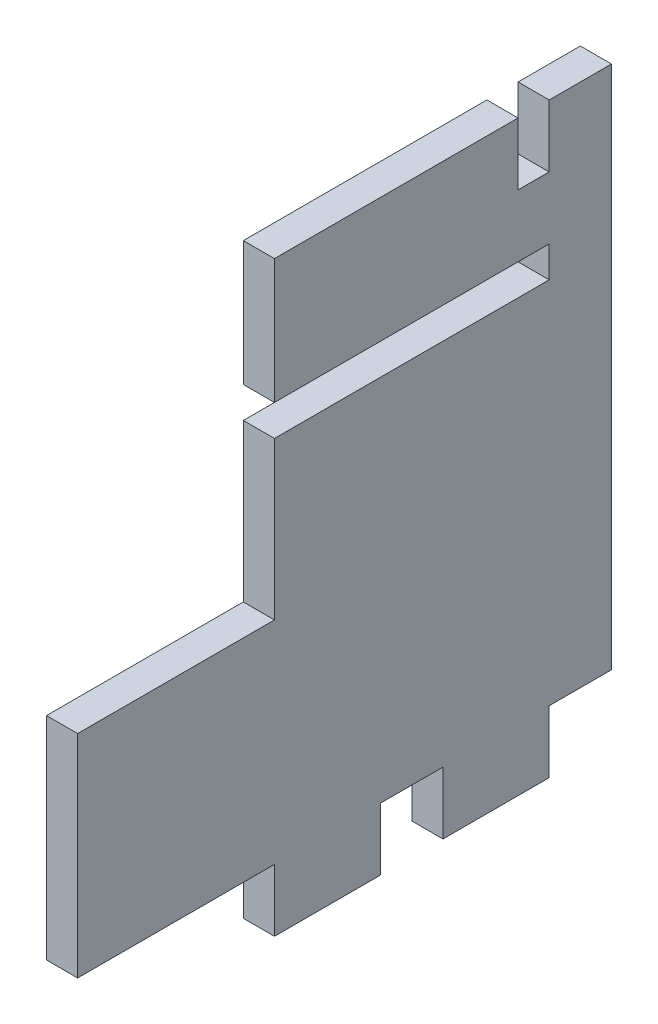
ISO-10303-21;
HEADER;
FILE_DESCRIPTION(('STEP AP214'),'2;1');
FILE_NAME('part.step','',(''),(''),'','','');
FILE_SCHEMA(('AUTOMOTIVE_DESIGN { 1 0 10303 214 1 1 1 1 }'));
ENDSEC;
DATA;
#1=APPLICATION_CONTEXT('core data for automotive mechanical design processes');
#2=APPLICATION_PROTOCOL_DEFINITION('international standard','automotive_design',2000,#1);
#3=PRODUCT_CONTEXT('',#1,'mechanical');
#4=PRODUCT('Part','Part','',(#3));
#5=PRODUCT_RELATED_PRODUCT_CATEGORY('part','',(#4));
#6=PRODUCT_DEFINITION_FORMATION('','',#4);
#7=PRODUCT_DEFINITION_CONTEXT('part definition',#1,'design');
#8=PRODUCT_DEFINITION('design','',#6,#7);
#9=PRODUCT_DEFINITION_SHAPE('','',#8);
#10=(LENGTH_UNIT() NAMED_UNIT(*) SI_UNIT(.MILLI.,.METRE.));
#11=(NAMED_UNIT(*) PLANE_ANGLE_UNIT() SI_UNIT($,.RADIAN.));
#12=(NAMED_UNIT(*) SI_UNIT($,.STERADIAN.) SOLID_ANGLE_UNIT());
#13=UNCERTAINTY_MEASURE_WITH_UNIT(LENGTH_MEASURE(1.E-05),#10,'distance_accuracy_value','');
#14=(GEOMETRIC_REPRESENTATION_CONTEXT(3) GLOBAL_UNCERTAINTY_ASSIGNED_CONTEXT((#13)) GLOBAL_UNIT_ASSIGNED_CONTEXT((#10,
#11,#12)) REPRESENTATION_CONTEXT('',''));
#15=CARTESIAN_POINT('',(0.,0.,0.));
#16=DIRECTION('',(0.,0.,1.));
#17=DIRECTION('',(1.,0.,0.));
#18=AXIS2_PLACEMENT_3D('',#15,#16,#17);
#19=CARTESIAN_POINT('',(3.175,-21.971,0.));
#20=DIRECTION('',(0.,1.,0.));
#21=DIRECTION('',(0.,0.,1.));
#22=AXIS2_PLACEMENT_3D('',#19,#20,#21);
#23=PLANE('',#22);
#24=DIRECTION('',(0.,0.,-1.));
#25=VECTOR('',#24,1.);
#26=CARTESIAN_POINT('',(0.,-21.971,0.));
#27=LINE('',#26,#25);
#28=CARTESIAN_POINT('',(0.,-21.971,-3.175));
#29=VERTEX_POINT('',#28);
#30=CARTESIAN_POINT('',(0.,-21.971,-14.));
#31=VERTEX_POINT('',#30);
#32=EDGE_CURVE('E217',#29,#31,#27,.T.);
#33=ORIENTED_EDGE('',*,*,#32,.T.);
#34=DIRECTION('',(-1.,0.,0.));
#35=VECTOR('',#34,1.);
#36=CARTESIAN_POINT('',(3.175,-21.971,-14.));
#37=LINE('',#36,#35);
#38=CARTESIAN_POINT('',(3.175,-21.971,-14.));
#39=VERTEX_POINT('',#38);
#40=EDGE_CURVE('E11',#39,#31,#37,.T.);
#41=ORIENTED_EDGE('',*,*,#40,.F.);
#42=DIRECTION('',(0.,0.,-1.));
#43=VECTOR('',#42,1.);
#44=CARTESIAN_POINT('',(3.175,-21.971,0.));
#45=LINE('',#44,#43);
#46=CARTESIAN_POINT('',(3.175,-21.971,-3.175));
#47=VERTEX_POINT('',#46);
#48=EDGE_CURVE('E134',#47,#39,#45,.T.);
#49=ORIENTED_EDGE('',*,*,#48,.F.);
#50=DIRECTION('',(-1.,0.,0.));
#51=VECTOR('',#50,1.);
#52=CARTESIAN_POINT('',(3.175,-21.971,-3.175));
#53=LINE('',#52,#51);
#54=EDGE_CURVE('E54',#47,#29,#53,.T.);
#55=ORIENTED_EDGE('',*,*,#54,.T.);
#56=EDGE_LOOP('',(#33,#41,#49,#55));
#57=FACE_BOUND('',#56,.T.);
#58=ADVANCED_FACE('F38',(#57),#23,.F.);
#59=CARTESIAN_POINT('',(3.175,0.,-14.));
#60=DIRECTION('',(0.,0.,-1.));
#61=DIRECTION('',(0.,1.,0.));
#62=AXIS2_PLACEMENT_3D('',#59,#60,#61);
#63=PLANE('',#62);
#64=DIRECTION('',(0.,-1.,0.));
#65=VECTOR('',#64,1.);
#66=CARTESIAN_POINT('',(0.,0.,-14.));
#67=LINE('',#66,#65);
#68=CARTESIAN_POINT('',(0.,-15.621,-14.));
#69=VERTEX_POINT('',#68);
#70=EDGE_CURVE('E219',#69,#31,#67,.T.);
#71=ORIENTED_EDGE('',*,*,#70,.F.);
#72=DIRECTION('',(-1.,0.,0.));
#73=VECTOR('',#72,1.);
#74=CARTESIAN_POINT('',(3.175,-15.621,-14.));
#75=LINE('',#74,#73);
#76=CARTESIAN_POINT('',(3.175,-15.621,-14.));
#77=VERTEX_POINT('',#76);
#78=EDGE_CURVE('E46',#77,#69,#75,.T.);
#79=ORIENTED_EDGE('',*,*,#78,.F.);
#80=DIRECTION('',(0.,-1.,0.));
#81=VECTOR('',#80,1.);
#82=CARTESIAN_POINT('',(3.175,0.,-14.));
#83=LINE('',#82,#81);
#84=EDGE_CURVE('E323',#77,#39,#83,.T.);
#85=ORIENTED_EDGE('',*,*,#84,.T.);
#86=ORIENTED_EDGE('',*,*,#40,.T.);
#87=EDGE_LOOP('',(#71,#79,#85,#86));
#88=FACE_BOUND('',#87,.T.);
#89=ADVANCED_FACE('F322',(#88),#63,.T.);
#90=CARTESIAN_POINT('',(3.175,-15.621,0.));
#91=DIRECTION('',(0.,1.,0.));
#92=DIRECTION('',(0.,0.,1.));
#93=AXIS2_PLACEMENT_3D('',#90,#91,#92);
#94=PLANE('',#93);
#95=DIRECTION('',(0.,0.,-1.));
#96=VECTOR('',#95,1.);
#97=CARTESIAN_POINT('',(0.,-15.621,0.));
#98=LINE('',#97,#96);
#99=CARTESIAN_POINT('',(0.,-15.621,-20.35));
#100=VERTEX_POINT('',#99);
#101=EDGE_CURVE('E222',#69,#100,#98,.T.);
#102=ORIENTED_EDGE('',*,*,#101,.T.);
#103=DIRECTION('',(-1.,0.,0.));
#104=VECTOR('',#103,1.);
#105=CARTESIAN_POINT('',(3.175,-15.621,-20.35));
#106=LINE('',#105,#104);
#107=CARTESIAN_POINT('',(3.175,-15.621,-20.35));
#108=VERTEX_POINT('',#107);
#109=EDGE_CURVE('E308',#108,#100,#106,.T.);
#110=ORIENTED_EDGE('',*,*,#109,.F.);
#111=DIRECTION('',(0.,0.,-1.));
#112=VECTOR('',#111,1.);
#113=CARTESIAN_POINT('',(3.175,-15.621,0.));
#114=LINE('',#113,#112);
#115=EDGE_CURVE('E314',#77,#108,#114,.T.);
#116=ORIENTED_EDGE('',*,*,#115,.F.);
#117=ORIENTED_EDGE('',*,*,#78,.T.);
#118=EDGE_LOOP('',(#102,#110,#116,#117));
#119=FACE_BOUND('',#118,.T.);
#120=ADVANCED_FACE('F312',(#119),#94,.F.);
#121=CARTESIAN_POINT('',(3.175,0.,-20.35));
#122=DIRECTION('',(0.,0.,-1.));
#123=DIRECTION('',(0.,1.,0.));
#124=AXIS2_PLACEMENT_3D('',#121,#122,#123);
#125=PLANE('',#124);
#126=DIRECTION('',(0.,-1.,0.));
#127=VECTOR('',#126,1.);
#128=CARTESIAN_POINT('',(0.,0.,-20.35));
#129=LINE('',#128,#127);
#130=CARTESIAN_POINT('',(0.,37.846,-20.35));
#131=VERTEX_POINT('',#130);
#132=EDGE_CURVE('E225',#131,#100,#129,.T.);
#133=ORIENTED_EDGE('',*,*,#132,.F.);
#134=DIRECTION('',(-1.,0.,0.));
#135=VECTOR('',#134,1.);
#136=CARTESIAN_POINT('',(3.175,37.846,-20.35));
#137=LINE('',#136,#135);
#138=CARTESIAN_POINT('',(3.175,37.846,-20.35));
#139=VERTEX_POINT('',#138);
#140=EDGE_CURVE('E306',#139,#131,#137,.T.);
#141=ORIENTED_EDGE('',*,*,#140,.F.);
#142=DIRECTION('',(0.,-1.,0.));
#143=VECTOR('',#142,1.);
#144=CARTESIAN_POINT('',(3.175,0.,-20.35));
#145=LINE('',#144,#143);
#146=EDGE_CURVE('E701',#139,#108,#145,.T.);
#147=ORIENTED_EDGE('',*,*,#146,.T.);
#148=ORIENTED_EDGE('',*,*,#109,.T.);
#149=EDGE_LOOP('',(#133,#141,#147,#148));
#150=FACE_BOUND('',#149,.T.);
#151=ADVANCED_FACE('F341',(#150),#125,.T.);
#152=CARTESIAN_POINT('',(3.175,37.846,0.));
#153=DIRECTION('',(0.,-1.,0.));
#154=DIRECTION('',(0.,0.,-1.));
#155=AXIS2_PLACEMENT_3D('',#152,#153,#154);
#156=PLANE('',#155);
#157=DIRECTION('',(0.,0.,1.));
#158=VECTOR('',#157,1.);
#159=CARTESIAN_POINT('',(0.,37.846,0.));
#160=LINE('',#159,#158);
#161=CARTESIAN_POINT('',(0.,37.846,-14.));
#162=VERTEX_POINT('',#161);
#163=EDGE_CURVE('E228',#131,#162,#160,.T.);
#164=ORIENTED_EDGE('',*,*,#163,.T.);
#165=DIRECTION('',(-1.,0.,0.));
#166=VECTOR('',#165,1.);
#167=CARTESIAN_POINT('',(3.175,37.846,-14.));
#168=LINE('',#167,#166);
#169=CARTESIAN_POINT('',(3.175,37.846,-14.));
#170=VERTEX_POINT('',#169);
#171=EDGE_CURVE('E303',#170,#162,#168,.T.);
#172=ORIENTED_EDGE('',*,*,#171,.F.);
#173=DIRECTION('',(0.,0.,1.));
#174=VECTOR('',#173,1.);
#175=CARTESIAN_POINT('',(3.175,37.846,0.));
#176=LINE('',#175,#174);
#177=EDGE_CURVE('E649',#139,#170,#176,.T.);
#178=ORIENTED_EDGE('',*,*,#177,.F.);
#179=ORIENTED_EDGE('',*,*,#140,.T.);
#180=EDGE_LOOP('',(#164,#172,#178,#179));
#181=FACE_BOUND('',#180,.T.);
#182=ADVANCED_FACE('F346',(#181),#156,.F.);
#183=CARTESIAN_POINT('',(3.175,0.,-14.));
#184=DIRECTION('',(0.,0.,-1.));
#185=DIRECTION('',(-1.,0.,0.));
#186=AXIS2_PLACEMENT_3D('',#183,#184,#185);
#187=PLANE('',#186);
#188=DIRECTION('',(0.,-1.,0.));
#189=VECTOR('',#188,1.);
#190=CARTESIAN_POINT('',(0.,0.,-14.));
#191=LINE('',#190,#189);
#192=CARTESIAN_POINT('',(0.,31.496,-14.));
#193=VERTEX_POINT('',#192);
#194=EDGE_CURVE('E230',#162,#193,#191,.T.);
#195=ORIENTED_EDGE('',*,*,#194,.T.);
#196=DIRECTION('',(-1.,0.,0.));
#197=VECTOR('',#196,1.);
#198=CARTESIAN_POINT('',(3.175,31.496,-14.));
#199=LINE('',#198,#197);
#200=CARTESIAN_POINT('',(3.175,31.496,-14.));
#201=VERTEX_POINT('',#200);
#202=EDGE_CURVE('E300',#201,#193,#199,.T.);
#203=ORIENTED_EDGE('',*,*,#202,.F.);
#204=DIRECTION('',(0.,-1.,0.));
#205=VECTOR('',#204,1.);
#206=CARTESIAN_POINT('',(3.175,0.,-14.));
#207=LINE('',#206,#205);
#208=EDGE_CURVE('E636',#170,#201,#207,.T.);
#209=ORIENTED_EDGE('',*,*,#208,.F.);
#210=ORIENTED_EDGE('',*,*,#171,.T.);
#211=EDGE_LOOP('',(#195,#203,#209,#210));
#212=FACE_BOUND('',#211,.T.);
#213=ADVANCED_FACE('F348',(#212),#187,.F.);
#214=CARTESIAN_POINT('',(3.175,31.496,0.));
#215=DIRECTION('',(0.,-1.,0.));
#216=DIRECTION('',(0.,0.,-1.));
#217=AXIS2_PLACEMENT_3D('',#214,#215,#216);
#218=PLANE('',#217);
#219=DIRECTION('',(0.,0.,1.));
#220=VECTOR('',#219,1.);
#221=CARTESIAN_POINT('',(0.,31.496,0.));
#222=LINE('',#221,#220);
#223=CARTESIAN_POINT('',(0.,31.496,-10.825));
#224=VERTEX_POINT('',#223);
#225=EDGE_CURVE('E233',#193,#224,#222,.T.);
#226=ORIENTED_EDGE('',*,*,#225,.T.);
#227=DIRECTION('',(-1.,0.,0.));
#228=VECTOR('',#227,1.);
#229=CARTESIAN_POINT('',(3.175,31.496,-10.825));
#230=LINE('',#229,#228);
#231=CARTESIAN_POINT('',(3.175,31.496,-10.825));
#232=VERTEX_POINT('',#231);
#233=EDGE_CURVE('E298',#232,#224,#230,.T.);
#234=ORIENTED_EDGE('',*,*,#233,.F.);
#235=DIRECTION('',(0.,0.,1.));
#236=VECTOR('',#235,1.);
#237=CARTESIAN_POINT('',(3.175,31.496,0.));
#238=LINE('',#237,#236);
#239=EDGE_CURVE('E643',#201,#232,#238,.T.);
#240=ORIENTED_EDGE('',*,*,#239,.F.);
#241=ORIENTED_EDGE('',*,*,#202,.T.);
#242=EDGE_LOOP('',(#226,#234,#240,#241));
#243=FACE_BOUND('',#242,.T.);
#244=ADVANCED_FACE('F351',(#243),#218,.F.);
#245=CARTESIAN_POINT('',(3.175,0.,-10.825));
#246=DIRECTION('',(0.,0.,-1.));
#247=DIRECTION('',(0.,1.,0.));
#248=AXIS2_PLACEMENT_3D('',#245,#246,#247);
#249=PLANE('',#248);
#250=DIRECTION('',(0.,-1.,0.));
#251=VECTOR('',#250,1.);
#252=CARTESIAN_POINT('',(0.,0.,-10.825));
#253=LINE('',#252,#251);
#254=CARTESIAN_POINT('',(0.,37.846,-10.825));
#255=VERTEX_POINT('',#254);
#256=EDGE_CURVE('E236',#255,#224,#253,.T.);
#257=ORIENTED_EDGE('',*,*,#256,.F.);
#258=DIRECTION('',(-1.,0.,0.));
#259=VECTOR('',#258,1.);
#260=CARTESIAN_POINT('',(3.175,37.846,-10.825));
#261=LINE('',#260,#259);
#262=CARTESIAN_POINT('',(3.175,37.846,-10.825));
#263=VERTEX_POINT('',#262);
#264=EDGE_CURVE('E296',#263,#255,#261,.T.);
#265=ORIENTED_EDGE('',*,*,#264,.F.);
#266=DIRECTION('',(0.,-1.,0.));
#267=VECTOR('',#266,1.);
#268=CARTESIAN_POINT('',(3.175,0.,-10.825));
#269=LINE('',#268,#267);
#270=EDGE_CURVE('E645',#263,#232,#269,.T.);
#271=ORIENTED_EDGE('',*,*,#270,.T.);
#272=ORIENTED_EDGE('',*,*,#233,.T.);
#273=EDGE_LOOP('',(#257,#265,#271,#272));
#274=FACE_BOUND('',#273,.T.);
#275=ADVANCED_FACE('F355',(#274),#249,.T.);
#276=CARTESIAN_POINT('',(0.,37.846,14.));
#277=VERTEX_POINT('',#276);
#278=EDGE_CURVE('E231',#255,#277,#160,.T.);
#279=ORIENTED_EDGE('',*,*,#278,.T.);
#280=DIRECTION('',(-1.,0.,0.));
#281=VECTOR('',#280,1.);
#282=CARTESIAN_POINT('',(3.175,37.846,14.));
#283=LINE('',#282,#281);
#284=CARTESIAN_POINT('',(3.175,37.846,14.));
#285=VERTEX_POINT('',#284);
#286=EDGE_CURVE('E294',#285,#277,#283,.T.);
#287=ORIENTED_EDGE('',*,*,#286,.F.);
#288=EDGE_CURVE('E647',#263,#285,#176,.T.);
#289=ORIENTED_EDGE('',*,*,#288,.F.);
#290=ORIENTED_EDGE('',*,*,#264,.T.);
#291=EDGE_LOOP('',(#279,#287,#289,#290));
#292=FACE_BOUND('',#291,.T.);
#293=ADVANCED_FACE('F359',(#292),#156,.F.);
#294=CARTESIAN_POINT('',(3.175,0.,14.));
#295=DIRECTION('',(0.,0.,1.));
#296=DIRECTION('',(0.,-1.,0.));
#297=AXIS2_PLACEMENT_3D('',#294,#295,#296);
#298=PLANE('',#297);
#299=DIRECTION('',(0.,1.,0.));
#300=VECTOR('',#299,1.);
#301=CARTESIAN_POINT('',(0.,0.,14.));
#302=LINE('',#301,#300);
#303=CARTESIAN_POINT('',(0.,25.146,14.));
#304=VERTEX_POINT('',#303);
#305=EDGE_CURVE('E239',#304,#277,#302,.T.);
#306=ORIENTED_EDGE('',*,*,#305,.F.);
#307=DIRECTION('',(-1.,0.,0.));
#308=VECTOR('',#307,1.);
#309=CARTESIAN_POINT('',(3.175,25.146,14.));
#310=LINE('',#309,#308);
#311=CARTESIAN_POINT('',(3.175,25.146,14.));
#312=VERTEX_POINT('',#311);
#313=EDGE_CURVE('E292',#312,#304,#310,.T.);
#314=ORIENTED_EDGE('',*,*,#313,.F.);
#315=DIRECTION('',(0.,1.,0.));
#316=VECTOR('',#315,1.);
#317=CARTESIAN_POINT('',(3.175,0.,14.));
#318=LINE('',#317,#316);
#319=EDGE_CURVE('E653',#312,#285,#318,.T.);
#320=ORIENTED_EDGE('',*,*,#319,.T.);
#321=ORIENTED_EDGE('',*,*,#286,.T.);
#322=EDGE_LOOP('',(#306,#314,#320,#321));
#323=FACE_BOUND('',#322,.T.);
#324=ADVANCED_FACE('F363',(#323),#298,.T.);
#325=CARTESIAN_POINT('',(3.175,25.146,0.));
#326=DIRECTION('',(0.,-1.,0.));
#327=DIRECTION('',(0.,0.,-1.));
#328=AXIS2_PLACEMENT_3D('',#325,#326,#327);
#329=PLANE('',#328);
#330=DIRECTION('',(0.,0.,1.));
#331=VECTOR('',#330,1.);
#332=CARTESIAN_POINT('',(0.,25.146,0.));
#333=LINE('',#332,#331);
#334=CARTESIAN_POINT('',(0.,25.146,-14.));
#335=VERTEX_POINT('',#334);
#336=EDGE_CURVE('E242',#335,#304,#333,.T.);
#337=ORIENTED_EDGE('',*,*,#336,.F.);
#338=DIRECTION('',(-1.,0.,0.));
#339=VECTOR('',#338,1.);
#340=CARTESIAN_POINT('',(3.175,25.146,-14.));
#341=LINE('',#340,#339);
#342=CARTESIAN_POINT('',(3.175,25.146,-14.));
#343=VERTEX_POINT('',#342);
#344=EDGE_CURVE('E290',#343,#335,#341,.T.);
#345=ORIENTED_EDGE('',*,*,#344,.F.);
#346=DIRECTION('',(0.,0.,1.));
#347=VECTOR('',#346,1.);
#348=CARTESIAN_POINT('',(3.175,25.146,0.));
#349=LINE('',#348,#347);
#350=EDGE_CURVE('E656',#343,#312,#349,.T.);
#351=ORIENTED_EDGE('',*,*,#350,.T.);
#352=ORIENTED_EDGE('',*,*,#313,.T.);
#353=EDGE_LOOP('',(#337,#345,#351,#352));
#354=FACE_BOUND('',#353,.T.);
#355=ADVANCED_FACE('F367',(#354),#329,.T.);
#356=CARTESIAN_POINT('',(3.175,0.,-14.));
#357=DIRECTION('',(0.,0.,1.));
#358=DIRECTION('',(1.,0.,0.));
#359=AXIS2_PLACEMENT_3D('',#356,#357,#358);
#360=PLANE('',#359);
#361=DIRECTION('',(0.,1.,0.));
#362=VECTOR('',#361,1.);
#363=CARTESIAN_POINT('',(0.,0.,-14.));
#364=LINE('',#363,#362);
#365=CARTESIAN_POINT('',(0.,21.971,-14.));
#366=VERTEX_POINT('',#365);
#367=EDGE_CURVE('E245',#366,#335,#364,.T.);
#368=ORIENTED_EDGE('',*,*,#367,.F.);
#369=DIRECTION('',(-1.,0.,0.));
#370=VECTOR('',#369,1.);
#371=CARTESIAN_POINT('',(3.175,21.971,-14.));
#372=LINE('',#371,#370);
#373=CARTESIAN_POINT('',(3.175,21.971,-14.));
#374=VERTEX_POINT('',#373);
#375=EDGE_CURVE('E288',#374,#366,#372,.T.);
#376=ORIENTED_EDGE('',*,*,#375,.F.);
#377=DIRECTION('',(0.,1.,0.));
#378=VECTOR('',#377,1.);
#379=CARTESIAN_POINT('',(3.175,0.,-14.));
#380=LINE('',#379,#378);
#381=EDGE_CURVE('E659',#374,#343,#380,.T.);
#382=ORIENTED_EDGE('',*,*,#381,.T.);
#383=ORIENTED_EDGE('',*,*,#344,.T.);
#384=EDGE_LOOP('',(#368,#376,#382,#383));
#385=FACE_BOUND('',#384,.T.);
#386=ADVANCED_FACE('F371',(#385),#360,.T.);
#387=CARTESIAN_POINT('',(3.175,21.971,0.));
#388=DIRECTION('',(0.,1.,0.));
#389=DIRECTION('',(0.,0.,1.));
#390=AXIS2_PLACEMENT_3D('',#387,#388,#389);
#391=PLANE('',#390);
#392=DIRECTION('',(0.,0.,-1.));
#393=VECTOR('',#392,1.);
#394=CARTESIAN_POINT('',(0.,21.971,0.));
#395=LINE('',#394,#393);
#396=CARTESIAN_POINT('',(0.,21.971,14.));
#397=VERTEX_POINT('',#396);
#398=EDGE_CURVE('E248',#397,#366,#395,.T.);
#399=ORIENTED_EDGE('',*,*,#398,.F.);
#400=DIRECTION('',(-1.,0.,0.));
#401=VECTOR('',#400,1.);
#402=CARTESIAN_POINT('',(3.175,21.971,14.));
#403=LINE('',#402,#401);
#404=CARTESIAN_POINT('',(3.175,21.971,14.));
#405=VERTEX_POINT('',#404);
#406=EDGE_CURVE('E286',#405,#397,#403,.T.);
#407=ORIENTED_EDGE('',*,*,#406,.F.);
#408=DIRECTION('',(0.,0.,-1.));
#409=VECTOR('',#408,1.);
#410=CARTESIAN_POINT('',(3.175,21.971,0.));
#411=LINE('',#410,#409);
#412=EDGE_CURVE('E662',#405,#374,#411,.T.);
#413=ORIENTED_EDGE('',*,*,#412,.T.);
#414=ORIENTED_EDGE('',*,*,#375,.T.);
#415=EDGE_LOOP('',(#399,#407,#413,#414));
#416=FACE_BOUND('',#415,.T.);
#417=ADVANCED_FACE('F375',(#416),#391,.T.);
#418=CARTESIAN_POINT('',(3.175,0.,14.));
#419=DIRECTION('',(0.,0.,-1.));
#420=DIRECTION('',(0.,1.,0.));
#421=AXIS2_PLACEMENT_3D('',#418,#419,#420);
#422=PLANE('',#421);
#423=DIRECTION('',(0.,-1.,0.));
#424=VECTOR('',#423,1.);
#425=CARTESIAN_POINT('',(0.,0.,14.));
#426=LINE('',#425,#424);
#427=CARTESIAN_POINT('',(0.,5.95400000000001,14.));
#428=VERTEX_POINT('',#427);
#429=EDGE_CURVE('E251',#397,#428,#426,.T.);
#430=ORIENTED_EDGE('',*,*,#429,.T.);
#431=DIRECTION('',(-1.,0.,0.));
#432=VECTOR('',#431,1.);
#433=CARTESIAN_POINT('',(3.175,5.95400000000001,14.));
#434=LINE('',#433,#432);
#435=CARTESIAN_POINT('',(3.175,5.95400000000001,14.));
#436=VERTEX_POINT('',#435);
#437=EDGE_CURVE('E283',#436,#428,#434,.T.);
#438=ORIENTED_EDGE('',*,*,#437,.F.);
#439=DIRECTION('',(0.,-1.,0.));
#440=VECTOR('',#439,1.);
#441=CARTESIAN_POINT('',(3.175,0.,14.));
#442=LINE('',#441,#440);
#443=EDGE_CURVE('E665',#405,#436,#442,.T.);
#444=ORIENTED_EDGE('',*,*,#443,.F.);
#445=ORIENTED_EDGE('',*,*,#406,.T.);
#446=EDGE_LOOP('',(#430,#438,#444,#445));
#447=FACE_BOUND('',#446,.T.);
#448=ADVANCED_FACE('F379',(#447),#422,.F.);
#449=CARTESIAN_POINT('',(3.175,5.95400000000003,0.));
#450=DIRECTION('',(0.,-1.,0.));
#451=DIRECTION('',(0.,0.,-1.));
#452=AXIS2_PLACEMENT_3D('',#449,#450,#451);
#453=PLANE('',#452);
#454=DIRECTION('',(0.,0.,1.));
#455=VECTOR('',#454,1.);
#456=CARTESIAN_POINT('',(0.,5.95400000000003,0.));
#457=LINE('',#456,#455);
#458=CARTESIAN_POINT('',(0.,5.954,34.058155972));
#459=VERTEX_POINT('',#458);
#460=EDGE_CURVE('E253',#428,#459,#457,.T.);
#461=ORIENTED_EDGE('',*,*,#460,.T.);
#462=DIRECTION('',(-1.,0.,0.));
#463=VECTOR('',#462,1.);
#464=CARTESIAN_POINT('',(3.175,5.954,34.058155972));
#465=LINE('',#464,#463);
#466=CARTESIAN_POINT('',(3.175,5.954,34.058155972));
#467=VERTEX_POINT('',#466);
#468=EDGE_CURVE('E280',#467,#459,#465,.T.);
#469=ORIENTED_EDGE('',*,*,#468,.F.);
#470=DIRECTION('',(0.,0.,1.));
#471=VECTOR('',#470,1.);
#472=CARTESIAN_POINT('',(3.175,5.95400000000003,0.));
#473=LINE('',#472,#471);
#474=EDGE_CURVE('E667',#436,#467,#473,.T.);
#475=ORIENTED_EDGE('',*,*,#474,.F.);
#476=ORIENTED_EDGE('',*,*,#437,.T.);
#477=EDGE_LOOP('',(#461,#469,#475,#476));
#478=FACE_BOUND('',#477,.T.);
#479=ADVANCED_FACE('F381',(#478),#453,.F.);
#480=CARTESIAN_POINT('',(3.175,0.,34.058155972));
#481=DIRECTION('',(0.,0.,-1.));
#482=DIRECTION('',(-1.,0.,0.));
#483=AXIS2_PLACEMENT_3D('',#480,#481,#482);
#484=PLANE('',#483);
#485=DIRECTION('',(0.,-1.,0.));
#486=VECTOR('',#485,1.);
#487=CARTESIAN_POINT('',(0.,0.,34.058155972));
#488=LINE('',#487,#486);
#489=CARTESIAN_POINT('',(0.,-15.621,34.058155972));
#490=VERTEX_POINT('',#489);
#491=EDGE_CURVE('E256',#459,#490,#488,.T.);
#492=ORIENTED_EDGE('',*,*,#491,.T.);
#493=DIRECTION('',(-1.,0.,0.));
#494=VECTOR('',#493,1.);
#495=CARTESIAN_POINT('',(3.175,-15.621,34.058155972));
#496=LINE('',#495,#494);
#497=CARTESIAN_POINT('',(3.175,-15.621,34.058155972));
#498=VERTEX_POINT('',#497);
#499=EDGE_CURVE('E277',#498,#490,#496,.T.);
#500=ORIENTED_EDGE('',*,*,#499,.F.);
#501=DIRECTION('',(0.,-1.,0.));
#502=VECTOR('',#501,1.);
#503=CARTESIAN_POINT('',(3.175,0.,34.058155972));
#504=LINE('',#503,#502);
#505=EDGE_CURVE('E670',#467,#498,#504,.T.);
#506=ORIENTED_EDGE('',*,*,#505,.F.);
#507=ORIENTED_EDGE('',*,*,#468,.T.);
#508=EDGE_LOOP('',(#492,#500,#506,#507));
#509=FACE_BOUND('',#508,.T.);
#510=ADVANCED_FACE('F384',(#509),#484,.F.);
#511=CARTESIAN_POINT('',(3.175,-15.621,0.));
#512=DIRECTION('',(0.,1.,0.));
#513=DIRECTION('',(0.,0.,1.));
#514=AXIS2_PLACEMENT_3D('',#511,#512,#513);
#515=PLANE('',#514);
#516=DIRECTION('',(0.,0.,-1.));
#517=VECTOR('',#516,1.);
#518=CARTESIAN_POINT('',(0.,-15.621,0.));
#519=LINE('',#518,#517);
#520=CARTESIAN_POINT('',(0.,-15.621,14.));
#521=VERTEX_POINT('',#520);
#522=EDGE_CURVE('E258',#490,#521,#519,.T.);
#523=ORIENTED_EDGE('',*,*,#522,.T.);
#524=DIRECTION('',(-1.,0.,0.));
#525=VECTOR('',#524,1.);
#526=CARTESIAN_POINT('',(3.175,-15.621,14.));
#527=LINE('',#526,#525);
#528=CARTESIAN_POINT('',(3.175,-15.621,14.));
#529=VERTEX_POINT('',#528);
#530=EDGE_CURVE('E274',#529,#521,#527,.T.);
#531=ORIENTED_EDGE('',*,*,#530,.F.);
#532=DIRECTION('',(0.,0.,-1.));
#533=VECTOR('',#532,1.);
#534=CARTESIAN_POINT('',(3.175,-15.621,0.));
#535=LINE('',#534,#533);
#536=EDGE_CURVE('E672',#498,#529,#535,.T.);
#537=ORIENTED_EDGE('',*,*,#536,.F.);
#538=ORIENTED_EDGE('',*,*,#499,.T.);
#539=EDGE_LOOP('',(#523,#531,#537,#538));
#540=FACE_BOUND('',#539,.T.);
#541=ADVANCED_FACE('F388',(#540),#515,.F.);
#542=CARTESIAN_POINT('',(0.,-21.971,14.));
#543=VERTEX_POINT('',#542);
#544=EDGE_CURVE('E254',#521,#543,#426,.T.);
#545=ORIENTED_EDGE('',*,*,#544,.T.);
#546=DIRECTION('',(-1.,0.,0.));
#547=VECTOR('',#546,1.);
#548=CARTESIAN_POINT('',(3.175,-21.971,14.));
#549=LINE('',#548,#547);
#550=CARTESIAN_POINT('',(3.175,-21.971,14.));
#551=VERTEX_POINT('',#550);
#552=EDGE_CURVE('E271',#551,#543,#549,.T.);
#553=ORIENTED_EDGE('',*,*,#552,.F.);
#554=EDGE_CURVE('E668',#529,#551,#442,.T.);
#555=ORIENTED_EDGE('',*,*,#554,.F.);
#556=ORIENTED_EDGE('',*,*,#530,.T.);
#557=EDGE_LOOP('',(#545,#553,#555,#556));
#558=FACE_BOUND('',#557,.T.);
#559=ADVANCED_FACE('F392',(#558),#422,.F.);
#560=CARTESIAN_POINT('',(3.175,-21.971,0.));
#561=DIRECTION('',(0.,1.,0.));
#562=DIRECTION('',(0.,0.,1.));
#563=AXIS2_PLACEMENT_3D('',#560,#561,#562);
#564=PLANE('',#563);
#565=DIRECTION('',(0.,0.,-1.));
#566=VECTOR('',#565,1.);
#567=CARTESIAN_POINT('',(0.,-21.971,0.));
#568=LINE('',#567,#566);
#569=CARTESIAN_POINT('',(0.,-21.971,3.175));
#570=VERTEX_POINT('',#569);
#571=EDGE_CURVE('E260',#543,#570,#568,.T.);
#572=ORIENTED_EDGE('',*,*,#571,.T.);
#573=DIRECTION('',(-1.,0.,0.));
#574=VECTOR('',#573,1.);
#575=CARTESIAN_POINT('',(3.175,-21.971,3.175));
#576=LINE('',#575,#574);
#577=CARTESIAN_POINT('',(3.175,-21.971,3.175));
#578=VERTEX_POINT('',#577);
#579=EDGE_CURVE('E209',#578,#570,#576,.T.);
#580=ORIENTED_EDGE('',*,*,#579,.F.);
#581=DIRECTION('',(0.,0.,-1.));
#582=VECTOR('',#581,1.);
#583=CARTESIAN_POINT('',(3.175,-21.971,0.));
#584=LINE('',#583,#582);
#585=EDGE_CURVE('E197',#551,#578,#584,.T.);
#586=ORIENTED_EDGE('',*,*,#585,.F.);
#587=ORIENTED_EDGE('',*,*,#552,.T.);
#588=EDGE_LOOP('',(#572,#580,#586,#587));
#589=FACE_BOUND('',#588,.T.);
#590=ADVANCED_FACE('F396',(#589),#564,.F.);
#591=CARTESIAN_POINT('',(3.175,0.,3.175));
#592=DIRECTION('',(0.,0.,1.));
#593=DIRECTION('',(1.,0.,0.));
#594=AXIS2_PLACEMENT_3D('',#591,#592,#593);
#595=PLANE('',#594);
#596=DIRECTION('',(0.,1.,0.));
#597=VECTOR('',#596,1.);
#598=CARTESIAN_POINT('',(0.,0.,3.175));
#599=LINE('',#598,#597);
#600=CARTESIAN_POINT('',(0.,-15.621,3.175));
#601=VERTEX_POINT('',#600);
#602=EDGE_CURVE('E206',#570,#601,#599,.T.);
#603=ORIENTED_EDGE('',*,*,#602,.T.);
#604=DIRECTION('',(-1.,0.,0.));
#605=VECTOR('',#604,1.);
#606=CARTESIAN_POINT('',(3.175,-15.621,3.175));
#607=LINE('',#606,#605);
#608=CARTESIAN_POINT('',(3.175,-15.621,3.175));
#609=VERTEX_POINT('',#608);
#610=EDGE_CURVE('E203',#609,#601,#607,.T.);
#611=ORIENTED_EDGE('',*,*,#610,.F.);
#612=DIRECTION('',(0.,1.,0.));
#613=VECTOR('',#612,1.);
#614=CARTESIAN_POINT('',(3.175,0.,3.175));
#615=LINE('',#614,#613);
#616=EDGE_CURVE('E191',#578,#609,#615,.T.);
#617=ORIENTED_EDGE('',*,*,#616,.F.);
#618=ORIENTED_EDGE('',*,*,#579,.T.);
#619=EDGE_LOOP('',(#603,#611,#617,#618));
#620=FACE_BOUND('',#619,.T.);
#621=ADVANCED_FACE('F204',(#620),#595,.F.);
#622=CARTESIAN_POINT('',(3.175,-15.621,0.));
#623=DIRECTION('',(0.,1.,0.));
#624=DIRECTION('',(0.,0.,1.));
#625=AXIS2_PLACEMENT_3D('',#622,#623,#624);
#626=PLANE('',#625);
#627=DIRECTION('',(0.,0.,-1.));
#628=VECTOR('',#627,1.);
#629=CARTESIAN_POINT('',(0.,-15.621,0.));
#630=LINE('',#629,#628);
#631=CARTESIAN_POINT('',(0.,-15.621,-3.175));
#632=VERTEX_POINT('',#631);
#633=EDGE_CURVE('E263',#601,#632,#630,.T.);
#634=ORIENTED_EDGE('',*,*,#633,.T.);
#635=DIRECTION('',(-1.,0.,0.));
#636=VECTOR('',#635,1.);
#637=CARTESIAN_POINT('',(3.175,-15.621,-3.175));
#638=LINE('',#637,#636);
#639=CARTESIAN_POINT('',(3.175,-15.621,-3.175));
#640=VERTEX_POINT('',#639);
#641=EDGE_CURVE('E122',#640,#632,#638,.T.);
#642=ORIENTED_EDGE('',*,*,#641,.F.);
#643=DIRECTION('',(0.,0.,-1.));
#644=VECTOR('',#643,1.);
#645=CARTESIAN_POINT('',(3.175,-15.621,0.));
#646=LINE('',#645,#644);
#647=EDGE_CURVE('E195',#609,#640,#646,.T.);
#648=ORIENTED_EDGE('',*,*,#647,.F.);
#649=ORIENTED_EDGE('',*,*,#610,.T.);
#650=EDGE_LOOP('',(#634,#642,#648,#649));
#651=FACE_BOUND('',#650,.T.);
#652=ADVANCED_FACE('F211',(#651),#626,.F.);
#653=CARTESIAN_POINT('',(3.175,0.,-3.175));
#654=DIRECTION('',(0.,0.,1.));
#655=DIRECTION('',(1.,0.,0.));
#656=AXIS2_PLACEMENT_3D('',#653,#654,#655);
#657=PLANE('',#656);
#658=DIRECTION('',(0.,1.,0.));
#659=VECTOR('',#658,1.);
#660=CARTESIAN_POINT('',(0.,0.,-3.175));
#661=LINE('',#660,#659);
#662=EDGE_CURVE('E265',#29,#632,#661,.T.);
#663=ORIENTED_EDGE('',*,*,#662,.F.);
#664=ORIENTED_EDGE('',*,*,#54,.F.);
#665=DIRECTION('',(0.,1.,0.));
#666=VECTOR('',#665,1.);
#667=CARTESIAN_POINT('',(3.175,0.,-3.175));
#668=LINE('',#667,#666);
#669=EDGE_CURVE('E212',#47,#640,#668,.T.);
#670=ORIENTED_EDGE('',*,*,#669,.T.);
#671=ORIENTED_EDGE('',*,*,#641,.T.);
#672=EDGE_LOOP('',(#663,#664,#670,#671));
#673=FACE_BOUND('',#672,.T.);
#674=ADVANCED_FACE('F324',(#673),#657,.T.);
#675=CARTESIAN_POINT('',(3.175,0.,0.));
#676=DIRECTION('',(1.,0.,0.));
#677=DIRECTION('',(0.,0.,-1.));
#678=AXIS2_PLACEMENT_3D('',#675,#676,#677);
#679=PLANE('',#678);
#680=ORIENTED_EDGE('',*,*,#48,.T.);
#681=ORIENTED_EDGE('',*,*,#84,.F.);
#682=ORIENTED_EDGE('',*,*,#115,.T.);
#683=ORIENTED_EDGE('',*,*,#146,.F.);
#684=ORIENTED_EDGE('',*,*,#177,.T.);
#685=ORIENTED_EDGE('',*,*,#208,.T.);
#686=ORIENTED_EDGE('',*,*,#239,.T.);
#687=ORIENTED_EDGE('',*,*,#270,.F.);
#688=ORIENTED_EDGE('',*,*,#288,.T.);
#689=ORIENTED_EDGE('',*,*,#319,.F.);
#690=ORIENTED_EDGE('',*,*,#350,.F.);
#691=ORIENTED_EDGE('',*,*,#381,.F.);
#692=ORIENTED_EDGE('',*,*,#412,.F.);
#693=ORIENTED_EDGE('',*,*,#443,.T.);
#694=ORIENTED_EDGE('',*,*,#474,.T.);
#695=ORIENTED_EDGE('',*,*,#505,.T.);
#696=ORIENTED_EDGE('',*,*,#536,.T.);
#697=ORIENTED_EDGE('',*,*,#554,.T.);
#698=ORIENTED_EDGE('',*,*,#585,.T.);
#699=ORIENTED_EDGE('',*,*,#616,.T.);
#700=ORIENTED_EDGE('',*,*,#647,.T.);
#701=ORIENTED_EDGE('',*,*,#669,.F.);
#702=EDGE_LOOP('',(#680,#681,#682,#683,#684,#685,#686,#687,#688,#689,#690,#691,#692,#693,#694,
#695,#696,#697,#698,#699,#700,#701));
#703=FACE_BOUND('',#702,.T.);
#704=ADVANCED_FACE('F193',(#703),#679,.T.);
#705=CARTESIAN_POINT('',(0.,0.,0.));
#706=DIRECTION('',(1.,0.,0.));
#707=DIRECTION('',(0.,0.,-1.));
#708=AXIS2_PLACEMENT_3D('',#705,#706,#707);
#709=PLANE('',#708);
#710=ORIENTED_EDGE('',*,*,#32,.F.);
#711=ORIENTED_EDGE('',*,*,#662,.T.);
#712=ORIENTED_EDGE('',*,*,#633,.F.);
#713=ORIENTED_EDGE('',*,*,#602,.F.);
#714=ORIENTED_EDGE('',*,*,#571,.F.);
#715=ORIENTED_EDGE('',*,*,#544,.F.);
#716=ORIENTED_EDGE('',*,*,#522,.F.);
#717=ORIENTED_EDGE('',*,*,#491,.F.);
#718=ORIENTED_EDGE('',*,*,#460,.F.);
#719=ORIENTED_EDGE('',*,*,#429,.F.);
#720=ORIENTED_EDGE('',*,*,#398,.T.);
#721=ORIENTED_EDGE('',*,*,#367,.T.);
#722=ORIENTED_EDGE('',*,*,#336,.T.);
#723=ORIENTED_EDGE('',*,*,#305,.T.);
#724=ORIENTED_EDGE('',*,*,#278,.F.);
#725=ORIENTED_EDGE('',*,*,#256,.T.);
#726=ORIENTED_EDGE('',*,*,#225,.F.);
#727=ORIENTED_EDGE('',*,*,#194,.F.);
#728=ORIENTED_EDGE('',*,*,#163,.F.);
#729=ORIENTED_EDGE('',*,*,#132,.T.);
#730=ORIENTED_EDGE('',*,*,#101,.F.);
#731=ORIENTED_EDGE('',*,*,#70,.T.);
#732=EDGE_LOOP('',(#710,#711,#712,#713,#714,#715,#716,#717,#718,#719,#720,#721,#722,#723,#724,
#725,#726,#727,#728,#729,#730,#731));
#733=FACE_BOUND('',#732,.T.);
#734=ADVANCED_FACE('F319',(#733),#709,.F.);
#735=CLOSED_SHELL('',(#58,#89,#120,#151,#182,#213,#244,#275,#293,#324,#355,#386,#417,#448,#479,
#510,#541,#559,#590,#621,#652,#674,#704,#734));
#736=MANIFOLD_SOLID_BREP('B2',#735);
#737=ADVANCED_BREP_SHAPE_REPRESENTATION('',(#18,#736),#14);
#738=SHAPE_DEFINITION_REPRESENTATION(#9,#737);
ENDSEC;
END-ISO-10303-21;
